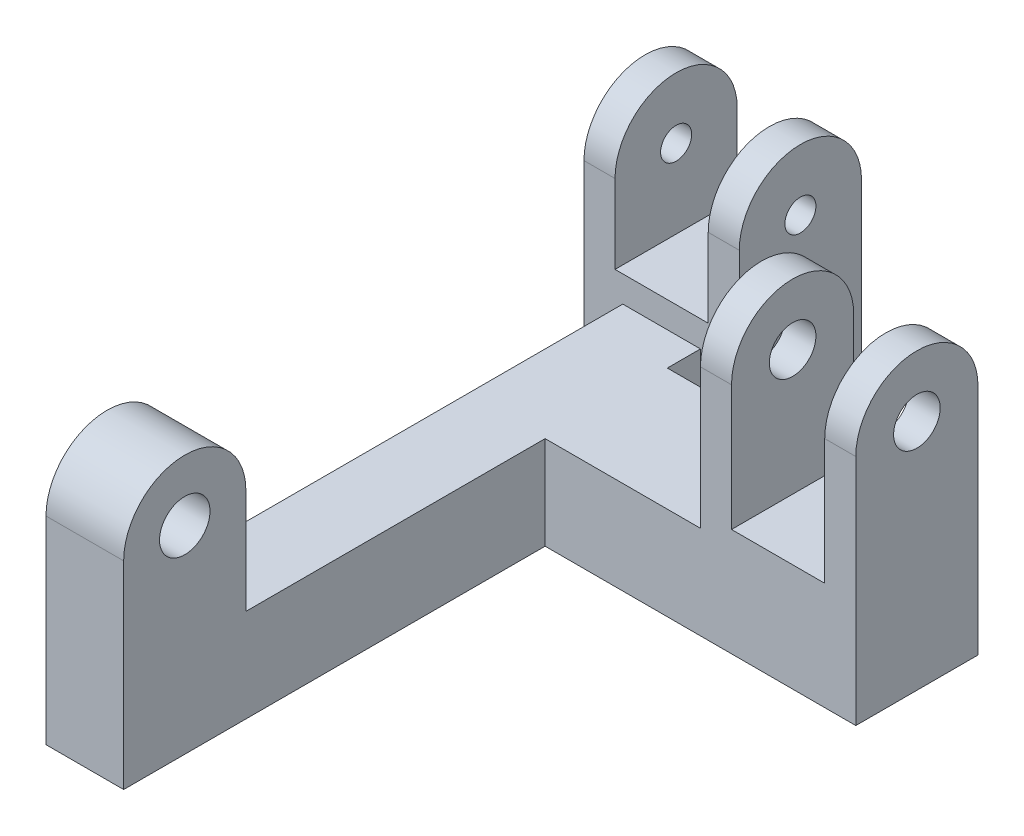
ISO-10303-21;
HEADER;
FILE_DESCRIPTION(('STEP AP214'),'2;1');
FILE_NAME('part.step','',(''),(''),'','','');
FILE_SCHEMA(('AUTOMOTIVE_DESIGN { 1 0 10303 214 1 1 1 1 }'));
ENDSEC;
DATA;
#1=APPLICATION_CONTEXT('core data for automotive mechanical design processes');
#2=APPLICATION_PROTOCOL_DEFINITION('international standard','automotive_design',2000,#1);
#3=PRODUCT_CONTEXT('',#1,'mechanical');
#4=PRODUCT('Part','Part','',(#3));
#5=PRODUCT_RELATED_PRODUCT_CATEGORY('part','',(#4));
#6=PRODUCT_DEFINITION_FORMATION('','',#4);
#7=PRODUCT_DEFINITION_CONTEXT('part definition',#1,'design');
#8=PRODUCT_DEFINITION('design','',#6,#7);
#9=PRODUCT_DEFINITION_SHAPE('','',#8);
#10=(LENGTH_UNIT() NAMED_UNIT(*) SI_UNIT(.MILLI.,.METRE.));
#11=(NAMED_UNIT(*) PLANE_ANGLE_UNIT() SI_UNIT($,.RADIAN.));
#12=(NAMED_UNIT(*) SI_UNIT($,.STERADIAN.) SOLID_ANGLE_UNIT());
#13=UNCERTAINTY_MEASURE_WITH_UNIT(LENGTH_MEASURE(1.E-05),#10,'distance_accuracy_value','');
#14=(GEOMETRIC_REPRESENTATION_CONTEXT(3) GLOBAL_UNCERTAINTY_ASSIGNED_CONTEXT((#13)) GLOBAL_UNIT_ASSIGNED_CONTEXT((#10,
#11,#12)) REPRESENTATION_CONTEXT('',''));
#15=CARTESIAN_POINT('',(0.,0.,0.));
#16=DIRECTION('',(0.,0.,1.));
#17=DIRECTION('',(1.,0.,0.));
#18=AXIS2_PLACEMENT_3D('',#15,#16,#17);
#19=CARTESIAN_POINT('',(-20.,0.,-6.06640543821817));
#20=DIRECTION('',(0.,0.,1.));
#21=DIRECTION('',(1.,0.,0.));
#22=AXIS2_PLACEMENT_3D('',#19,#20,#21);
#23=PLANE('',#22);
#24=DIRECTION('',(1.,0.,0.));
#25=VECTOR('',#24,1.);
#26=CARTESIAN_POINT('',(-20.,-2.25,-6.06640543821817));
#27=LINE('',#26,#25);
#28=CARTESIAN_POINT('',(-14.5,-2.25,-6.06640543821818));
#29=VERTEX_POINT('',#28);
#30=CARTESIAN_POINT('',(-12.5,-2.25,-6.06640543821818));
#31=VERTEX_POINT('',#30);
#32=EDGE_CURVE('E218',#29,#31,#27,.T.);
#33=ORIENTED_EDGE('',*,*,#32,.F.);
#34=DIRECTION('',(0.,-1.,0.));
#35=VECTOR('',#34,1.);
#36=CARTESIAN_POINT('',(-14.5,1.68359456178183,-6.06640543821817));
#37=LINE('',#36,#35);
#38=CARTESIAN_POINT('',(-14.5,-7.31640543821817,-6.06640543821817));
#39=VERTEX_POINT('',#38);
#40=EDGE_CURVE('E200',#29,#39,#37,.T.);
#41=ORIENTED_EDGE('',*,*,#40,.T.);
#42=DIRECTION('',(-1.,0.,0.));
#43=VECTOR('',#42,1.);
#44=CARTESIAN_POINT('',(-14.5,-7.31640543821817,-6.06640543821817));
#45=LINE('',#44,#43);
#46=CARTESIAN_POINT('',(-20.5,-7.31640543821817,-6.06640543821817));
#47=VERTEX_POINT('',#46);
#48=EDGE_CURVE('E433',#39,#47,#45,.T.);
#49=ORIENTED_EDGE('',*,*,#48,.T.);
#50=DIRECTION('',(0.,1.,0.));
#51=VECTOR('',#50,1.);
#52=CARTESIAN_POINT('',(-20.5,1.68359456178183,-6.06640543821817));
#53=LINE('',#52,#51);
#54=CARTESIAN_POINT('',(-20.5,-2.25,-6.06640543821818));
#55=VERTEX_POINT('',#54);
#56=EDGE_CURVE('E435',#47,#55,#53,.T.);
#57=ORIENTED_EDGE('',*,*,#56,.T.);
#58=CARTESIAN_POINT('',(-22.5,-2.25,-6.06640543821818));
#59=VERTEX_POINT('',#58);
#60=EDGE_CURVE('E226',#59,#55,#27,.T.);
#61=ORIENTED_EDGE('',*,*,#60,.F.);
#62=DIRECTION('',(0.,1.,0.));
#63=VECTOR('',#62,1.);
#64=CARTESIAN_POINT('',(-22.5,-2.25,-6.06640543821817));
#65=LINE('',#64,#63);
#66=CARTESIAN_POINT('',(-22.5,-15.,-6.06640543821817));
#67=VERTEX_POINT('',#66);
#68=EDGE_CURVE('E392',#67,#59,#65,.T.);
#69=ORIENTED_EDGE('',*,*,#68,.F.);
#70=DIRECTION('',(1.,0.,0.));
#71=VECTOR('',#70,1.);
#72=CARTESIAN_POINT('',(-22.5,-15.,-6.06640543821817));
#73=LINE('',#72,#71);
#74=CARTESIAN_POINT('',(-20.,-15.,-6.06640543821817));
#75=VERTEX_POINT('',#74);
#76=EDGE_CURVE('E341',#67,#75,#73,.T.);
#77=ORIENTED_EDGE('',*,*,#76,.T.);
#78=DIRECTION('',(0.,-1.,0.));
#79=VECTOR('',#78,1.);
#80=CARTESIAN_POINT('',(-20.,0.,-6.06640543821817));
#81=LINE('',#80,#79);
#82=CARTESIAN_POINT('',(-20.,-9.,-6.06640543821817));
#83=VERTEX_POINT('',#82);
#84=EDGE_CURVE('E47',#83,#75,#81,.T.);
#85=ORIENTED_EDGE('',*,*,#84,.F.);
#86=DIRECTION('',(1.,0.,0.));
#87=VECTOR('',#86,1.);
#88=CARTESIAN_POINT('',(-20.,-9.,-6.06640543821817));
#89=LINE('',#88,#87);
#90=CARTESIAN_POINT('',(-15.,-9.,-6.06640543821817));
#91=VERTEX_POINT('',#90);
#92=EDGE_CURVE('E230',#83,#91,#89,.T.);
#93=ORIENTED_EDGE('',*,*,#92,.T.);
#94=DIRECTION('',(0.,-1.,0.));
#95=VECTOR('',#94,1.);
#96=CARTESIAN_POINT('',(-15.,0.,-6.06640543821817));
#97=LINE('',#96,#95);
#98=CARTESIAN_POINT('',(-15.,-15.,-6.06640543821817));
#99=VERTEX_POINT('',#98);
#100=EDGE_CURVE('E356',#91,#99,#97,.T.);
#101=ORIENTED_EDGE('',*,*,#100,.T.);
#102=CARTESIAN_POINT('',(-12.5,-15.,-6.06640543821817));
#103=VERTEX_POINT('',#102);
#104=EDGE_CURVE('E401',#99,#103,#73,.T.);
#105=ORIENTED_EDGE('',*,*,#104,.T.);
#106=DIRECTION('',(0.,1.,0.));
#107=VECTOR('',#106,1.);
#108=CARTESIAN_POINT('',(-12.5,-2.25,-6.06640543821817));
#109=LINE('',#108,#107);
#110=EDGE_CURVE('E225',#103,#31,#109,.T.);
#111=ORIENTED_EDGE('',*,*,#110,.T.);
#112=EDGE_LOOP('',(#33,#41,#49,#57,#61,#69,#77,#85,#93,#101,#105,#111));
#113=FACE_BOUND('',#112,.T.);
#114=ADVANCED_FACE('F39',(#113),#23,.T.);
#115=CARTESIAN_POINT('',(-20.,-2.25,-10.));
#116=DIRECTION('',(1.,0.,0.));
#117=DIRECTION('',(0.,0.,-1.));
#118=AXIS2_PLACEMENT_3D('',#115,#116,#117);
#119=CYLINDRICAL_SURFACE('',#118,3.93359456178183);
#120=CARTESIAN_POINT('',(-14.5,-2.25,-10.));
#121=DIRECTION('',(1.,0.,0.));
#122=DIRECTION('',(0.,0.,-1.));
#123=AXIS2_PLACEMENT_3D('',#120,#121,#122);
#124=CIRCLE('',#123,3.93359456178183);
#125=CARTESIAN_POINT('',(-14.5,-2.25,-13.9335945617818));
#126=VERTEX_POINT('',#125);
#127=EDGE_CURVE('E204',#29,#126,#124,.F.);
#128=ORIENTED_EDGE('',*,*,#127,.F.);
#129=ORIENTED_EDGE('',*,*,#32,.T.);
#130=CARTESIAN_POINT('',(-12.5,-2.25,-10.));
#131=DIRECTION('',(-1.,0.,0.));
#132=DIRECTION('',(0.,0.,1.));
#133=AXIS2_PLACEMENT_3D('',#130,#131,#132);
#134=CIRCLE('',#133,3.93359456178183);
#135=CARTESIAN_POINT('',(-12.5,-2.25,-13.9335945617818));
#136=VERTEX_POINT('',#135);
#137=EDGE_CURVE('E378',#31,#136,#134,.T.);
#138=ORIENTED_EDGE('',*,*,#137,.T.);
#139=DIRECTION('',(1.,0.,0.));
#140=VECTOR('',#139,1.);
#141=CARTESIAN_POINT('',(-20.,-2.25,-13.9335945617818));
#142=LINE('',#141,#140);
#143=EDGE_CURVE('E220',#126,#136,#142,.T.);
#144=ORIENTED_EDGE('',*,*,#143,.F.);
#145=EDGE_LOOP('',(#128,#129,#138,#144));
#146=FACE_BOUND('',#145,.T.);
#147=ADVANCED_FACE('F216',(#146),#119,.T.);
#148=CARTESIAN_POINT('',(-20.5,-2.25,-10.));
#149=DIRECTION('',(-1.,0.,0.));
#150=DIRECTION('',(0.,0.,1.));
#151=AXIS2_PLACEMENT_3D('',#148,#149,#150);
#152=CIRCLE('',#151,3.93359456178183);
#153=CARTESIAN_POINT('',(-20.5,-2.25,-13.9335945617818));
#154=VERTEX_POINT('',#153);
#155=EDGE_CURVE('E221',#154,#55,#152,.F.);
#156=ORIENTED_EDGE('',*,*,#155,.F.);
#157=CARTESIAN_POINT('',(-22.5,-2.25,-13.9335945617818));
#158=VERTEX_POINT('',#157);
#159=EDGE_CURVE('E227',#158,#154,#142,.T.);
#160=ORIENTED_EDGE('',*,*,#159,.F.);
#161=CARTESIAN_POINT('',(-22.5,-2.25,-10.));
#162=DIRECTION('',(-1.,0.,0.));
#163=DIRECTION('',(0.,0.,1.));
#164=AXIS2_PLACEMENT_3D('',#161,#162,#163);
#165=CIRCLE('',#164,3.93359456178183);
#166=EDGE_CURVE('E395',#59,#158,#165,.T.);
#167=ORIENTED_EDGE('',*,*,#166,.F.);
#168=ORIENTED_EDGE('',*,*,#60,.T.);
#169=EDGE_LOOP('',(#156,#160,#167,#168));
#170=FACE_BOUND('',#169,.T.);
#171=ADVANCED_FACE('F461',(#170),#119,.T.);
#172=CARTESIAN_POINT('',(-20.,0.,-13.9335945617818));
#173=DIRECTION('',(0.,0.,-1.));
#174=DIRECTION('',(0.,1.,0.));
#175=AXIS2_PLACEMENT_3D('',#172,#173,#174);
#176=PLANE('',#175);
#177=DIRECTION('',(1.,0.,0.));
#178=VECTOR('',#177,1.);
#179=CARTESIAN_POINT('',(-20.,-7.31640543821817,-13.9335945617818));
#180=LINE('',#179,#178);
#181=CARTESIAN_POINT('',(-20.5,-7.31640543821817,-13.9335945617818));
#182=VERTEX_POINT('',#181);
#183=CARTESIAN_POINT('',(-14.5,-7.31640543821817,-13.9335945617818));
#184=VERTEX_POINT('',#183);
#185=EDGE_CURVE('E11',#182,#184,#180,.T.);
#186=ORIENTED_EDGE('',*,*,#185,.T.);
#187=DIRECTION('',(0.,1.,0.));
#188=VECTOR('',#187,1.);
#189=CARTESIAN_POINT('',(-14.5,0.,-13.9335945617818));
#190=LINE('',#189,#188);
#191=EDGE_CURVE('E377',#184,#126,#190,.T.);
#192=ORIENTED_EDGE('',*,*,#191,.T.);
#193=ORIENTED_EDGE('',*,*,#143,.T.);
#194=DIRECTION('',(0.,-1.,0.));
#195=VECTOR('',#194,1.);
#196=CARTESIAN_POINT('',(-12.5,-15.,-13.9335945617818));
#197=LINE('',#196,#195);
#198=CARTESIAN_POINT('',(-12.5,-15.,-13.9335945617818));
#199=VERTEX_POINT('',#198);
#200=EDGE_CURVE('E376',#136,#199,#197,.T.);
#201=ORIENTED_EDGE('',*,*,#200,.T.);
#202=DIRECTION('',(1.,0.,0.));
#203=VECTOR('',#202,1.);
#204=CARTESIAN_POINT('',(-20.,-15.,-13.9335945617818));
#205=LINE('',#204,#203);
#206=CARTESIAN_POINT('',(-22.5,-15.,-13.9335945617818));
#207=VERTEX_POINT('',#206);
#208=EDGE_CURVE('E346',#207,#199,#205,.T.);
#209=ORIENTED_EDGE('',*,*,#208,.F.);
#210=DIRECTION('',(0.,-1.,0.));
#211=VECTOR('',#210,1.);
#212=CARTESIAN_POINT('',(-22.5,-15.,-13.9335945617818));
#213=LINE('',#212,#211);
#214=EDGE_CURVE('E398',#158,#207,#213,.T.);
#215=ORIENTED_EDGE('',*,*,#214,.F.);
#216=ORIENTED_EDGE('',*,*,#159,.T.);
#217=DIRECTION('',(0.,-1.,0.));
#218=VECTOR('',#217,1.);
#219=CARTESIAN_POINT('',(-20.5,0.,-13.9335945617818));
#220=LINE('',#219,#218);
#221=EDGE_CURVE('E428',#154,#182,#220,.T.);
#222=ORIENTED_EDGE('',*,*,#221,.T.);
#223=EDGE_LOOP('',(#186,#192,#193,#201,#209,#215,#216,#222));
#224=FACE_BOUND('',#223,.T.);
#225=ADVANCED_FACE('F374',(#224),#176,.T.);
#226=CARTESIAN_POINT('',(-20.,-2.25,-10.));
#227=DIRECTION('',(1.,0.,0.));
#228=DIRECTION('',(0.,0.,-1.));
#229=AXIS2_PLACEMENT_3D('',#226,#227,#228);
#230=CYLINDRICAL_SURFACE('',#229,1.);
#231=CARTESIAN_POINT('',(-12.5,-2.25,-10.));
#232=DIRECTION('',(-1.,0.,0.));
#233=DIRECTION('',(0.,0.,1.));
#234=AXIS2_PLACEMENT_3D('',#231,#232,#233);
#235=CIRCLE('',#234,1.);
#236=CARTESIAN_POINT('',(-12.5,-2.25,-9.));
#237=VERTEX_POINT('',#236);
#238=EDGE_CURVE('E422',#237,#237,#235,.T.);
#239=ORIENTED_EDGE('',*,*,#238,.F.);
#240=EDGE_LOOP('',(#239));
#241=FACE_BOUND('',#240,.T.);
#242=CARTESIAN_POINT('',(-14.5,-2.25,-10.));
#243=DIRECTION('',(1.,0.,0.));
#244=DIRECTION('',(0.,0.,-1.));
#245=AXIS2_PLACEMENT_3D('',#242,#243,#244);
#246=CIRCLE('',#245,1.);
#247=CARTESIAN_POINT('',(-14.5,-2.25,-11.));
#248=VERTEX_POINT('',#247);
#249=EDGE_CURVE('E212',#248,#248,#246,.F.);
#250=ORIENTED_EDGE('',*,*,#249,.T.);
#251=EDGE_LOOP('',(#250));
#252=FACE_BOUND('',#251,.T.);
#253=ADVANCED_FACE('F556',(#241,#252),#230,.F.);
#254=CARTESIAN_POINT('',(-22.5,-2.25,-10.));
#255=DIRECTION('',(-1.,0.,0.));
#256=DIRECTION('',(0.,0.,1.));
#257=AXIS2_PLACEMENT_3D('',#254,#255,#256);
#258=CIRCLE('',#257,1.);
#259=CARTESIAN_POINT('',(-22.5,-2.25,-9.));
#260=VERTEX_POINT('',#259);
#261=EDGE_CURVE('E383',#260,#260,#258,.T.);
#262=ORIENTED_EDGE('',*,*,#261,.T.);
#263=EDGE_LOOP('',(#262));
#264=FACE_BOUND('',#263,.T.);
#265=CARTESIAN_POINT('',(-20.5,-2.25,-10.));
#266=DIRECTION('',(-1.,0.,0.));
#267=DIRECTION('',(0.,0.,1.));
#268=AXIS2_PLACEMENT_3D('',#265,#266,#267);
#269=CIRCLE('',#268,1.);
#270=CARTESIAN_POINT('',(-20.5,-2.25,-9.));
#271=VERTEX_POINT('',#270);
#272=EDGE_CURVE('E437',#271,#271,#269,.F.);
#273=ORIENTED_EDGE('',*,*,#272,.T.);
#274=EDGE_LOOP('',(#273));
#275=FACE_BOUND('',#274,.T.);
#276=ADVANCED_FACE('F445',(#264,#275),#230,.F.);
#277=CARTESIAN_POINT('',(-15.,0.,0.));
#278=DIRECTION('',(-1.,0.,0.));
#279=DIRECTION('',(0.,0.,1.));
#280=AXIS2_PLACEMENT_3D('',#277,#278,#279);
#281=PLANE('',#280);
#282=ORIENTED_EDGE('',*,*,#100,.F.);
#283=DIRECTION('',(0.,0.,-1.));
#284=VECTOR('',#283,1.);
#285=CARTESIAN_POINT('',(-15.,-9.,0.));
#286=LINE('',#285,#284);
#287=CARTESIAN_POINT('',(-15.,-9.,-3.93359456178183));
#288=VERTEX_POINT('',#287);
#289=EDGE_CURVE('E363',#288,#91,#286,.T.);
#290=ORIENTED_EDGE('',*,*,#289,.F.);
#291=DIRECTION('',(0.,-1.,0.));
#292=VECTOR('',#291,1.);
#293=CARTESIAN_POINT('',(-15.,-15.,-3.93359456178183));
#294=LINE('',#293,#292);
#295=CARTESIAN_POINT('',(-15.,-15.,-3.93359456178183));
#296=VERTEX_POINT('',#295);
#297=EDGE_CURVE('E247',#288,#296,#294,.T.);
#298=ORIENTED_EDGE('',*,*,#297,.T.);
#299=DIRECTION('',(0.,0.,-1.));
#300=VECTOR('',#299,1.);
#301=CARTESIAN_POINT('',(-15.,-15.,0.));
#302=LINE('',#301,#300);
#303=EDGE_CURVE('E62',#296,#99,#302,.T.);
#304=ORIENTED_EDGE('',*,*,#303,.T.);
#305=EDGE_LOOP('',(#282,#290,#298,#304));
#306=FACE_BOUND('',#305,.T.);
#307=ADVANCED_FACE('F547',(#306),#281,.F.);
#308=CARTESIAN_POINT('',(-20.,0.,0.));
#309=DIRECTION('',(-1.,0.,0.));
#310=DIRECTION('',(0.,0.,1.));
#311=AXIS2_PLACEMENT_3D('',#308,#309,#310);
#312=PLANE('',#311);
#313=CARTESIAN_POINT('',(-20.,-2.25,27.1328108764363));
#314=DIRECTION('',(-1.,0.,0.));
#315=DIRECTION('',(0.,0.,1.));
#316=AXIS2_PLACEMENT_3D('',#313,#314,#315);
#317=CIRCLE('',#316,1.625);
#318=CARTESIAN_POINT('',(-20.,-2.25,28.7578108764363));
#319=VERTEX_POINT('',#318);
#320=EDGE_CURVE('E369',#319,#319,#317,.T.);
#321=ORIENTED_EDGE('',*,*,#320,.F.);
#322=EDGE_LOOP('',(#321));
#323=FACE_BOUND('',#322,.T.);
#324=DIRECTION('',(0.,0.,-1.));
#325=VECTOR('',#324,1.);
#326=CARTESIAN_POINT('',(-20.,-9.,0.));
#327=LINE('',#326,#325);
#328=CARTESIAN_POINT('',(-20.,-9.,23.1992163146545));
#329=VERTEX_POINT('',#328);
#330=EDGE_CURVE('E335',#329,#83,#327,.T.);
#331=ORIENTED_EDGE('',*,*,#330,.T.);
#332=ORIENTED_EDGE('',*,*,#84,.T.);
#333=DIRECTION('',(0.,0.,-1.));
#334=VECTOR('',#333,1.);
#335=CARTESIAN_POINT('',(-20.,-15.,0.));
#336=LINE('',#335,#334);
#337=CARTESIAN_POINT('',(-20.,-15.,31.0664054382182));
#338=VERTEX_POINT('',#337);
#339=EDGE_CURVE('E333',#338,#75,#336,.T.);
#340=ORIENTED_EDGE('',*,*,#339,.F.);
#341=DIRECTION('',(0.,1.,0.));
#342=VECTOR('',#341,1.);
#343=CARTESIAN_POINT('',(-20.,0.,31.0664054382182));
#344=LINE('',#343,#342);
#345=CARTESIAN_POINT('',(-20.,-2.25,31.0664054382182));
#346=VERTEX_POINT('',#345);
#347=EDGE_CURVE('E406',#338,#346,#344,.T.);
#348=ORIENTED_EDGE('',*,*,#347,.T.);
#349=CARTESIAN_POINT('',(-20.,-2.25,27.1328108764363));
#350=DIRECTION('',(-1.,0.,0.));
#351=DIRECTION('',(0.,0.,1.));
#352=AXIS2_PLACEMENT_3D('',#349,#350,#351);
#353=CIRCLE('',#352,3.93359456178183);
#354=CARTESIAN_POINT('',(-20.,-2.25,23.1992163146545));
#355=VERTEX_POINT('',#354);
#356=EDGE_CURVE('E408',#346,#355,#353,.T.);
#357=ORIENTED_EDGE('',*,*,#356,.T.);
#358=DIRECTION('',(0.,-1.,0.));
#359=VECTOR('',#358,1.);
#360=CARTESIAN_POINT('',(-20.,0.,23.1992163146545));
#361=LINE('',#360,#359);
#362=EDGE_CURVE('E348',#355,#329,#361,.T.);
#363=ORIENTED_EDGE('',*,*,#362,.T.);
#364=EDGE_LOOP('',(#331,#332,#340,#348,#357,#363));
#365=FACE_BOUND('',#364,.T.);
#366=ADVANCED_FACE('F331',(#323,#365),#312,.T.);
#367=CARTESIAN_POINT('',(-5.,0.,0.));
#368=DIRECTION('',(1.,0.,0.));
#369=DIRECTION('',(0.,0.,-1.));
#370=AXIS2_PLACEMENT_3D('',#367,#368,#369);
#371=PLANE('',#370);
#372=CARTESIAN_POINT('',(-5.,0.,0.));
#373=DIRECTION('',(1.,0.,0.));
#374=DIRECTION('',(0.,0.,-1.));
#375=AXIS2_PLACEMENT_3D('',#372,#373,#374);
#376=CIRCLE('',#375,1.5);
#377=CARTESIAN_POINT('',(-5.,0.,-1.5));
#378=VERTEX_POINT('',#377);
#379=EDGE_CURVE('E288',#378,#378,#376,.T.);
#380=ORIENTED_EDGE('',*,*,#379,.T.);
#381=EDGE_LOOP('',(#380));
#382=FACE_BOUND('',#381,.T.);
#383=DIRECTION('',(0.,0.,-1.));
#384=VECTOR('',#383,1.);
#385=CARTESIAN_POINT('',(-5.,-9.,-3.93359456178183));
#386=LINE('',#385,#384);
#387=CARTESIAN_POINT('',(-5.,-9.,3.93359456178183));
#388=VERTEX_POINT('',#387);
#389=CARTESIAN_POINT('',(-5.,-9.,-3.93359456178183));
#390=VERTEX_POINT('',#389);
#391=EDGE_CURVE('E246',#388,#390,#386,.T.);
#392=ORIENTED_EDGE('',*,*,#391,.F.);
#393=DIRECTION('',(0.,-1.,0.));
#394=VECTOR('',#393,1.);
#395=CARTESIAN_POINT('',(-5.,-15.,3.93359456178183));
#396=LINE('',#395,#394);
#397=CARTESIAN_POINT('',(-5.,0.,3.93359456178183));
#398=VERTEX_POINT('',#397);
#399=EDGE_CURVE('E308',#398,#388,#396,.T.);
#400=ORIENTED_EDGE('',*,*,#399,.F.);
#401=CARTESIAN_POINT('',(-5.,0.,0.));
#402=DIRECTION('',(1.,0.,0.));
#403=DIRECTION('',(0.,0.,-1.));
#404=AXIS2_PLACEMENT_3D('',#401,#402,#403);
#405=CIRCLE('',#404,3.93359456178183);
#406=CARTESIAN_POINT('',(-5.,0.,-3.93359456178183));
#407=VERTEX_POINT('',#406);
#408=EDGE_CURVE('E292',#407,#398,#405,.T.);
#409=ORIENTED_EDGE('',*,*,#408,.F.);
#410=DIRECTION('',(0.,1.,0.));
#411=VECTOR('',#410,1.);
#412=CARTESIAN_POINT('',(-5.,0.,-3.93359456178183));
#413=LINE('',#412,#411);
#414=EDGE_CURVE('E299',#390,#407,#413,.T.);
#415=ORIENTED_EDGE('',*,*,#414,.F.);
#416=EDGE_LOOP('',(#392,#400,#409,#415));
#417=FACE_BOUND('',#416,.T.);
#418=ADVANCED_FACE('F505',(#382,#417),#371,.F.);
#419=CARTESIAN_POINT('',(5.,0.,0.));
#420=DIRECTION('',(-1.,0.,0.));
#421=DIRECTION('',(0.,0.,1.));
#422=AXIS2_PLACEMENT_3D('',#419,#420,#421);
#423=CYLINDRICAL_SURFACE('',#422,3.93359456178183);
#424=DIRECTION('',(-1.,0.,0.));
#425=VECTOR('',#424,1.);
#426=CARTESIAN_POINT('',(5.,0.,3.93359456178183));
#427=LINE('',#426,#425);
#428=CARTESIAN_POINT('',(-3.,0.,3.93359456178183));
#429=VERTEX_POINT('',#428);
#430=EDGE_CURVE('E319',#429,#398,#427,.T.);
#431=ORIENTED_EDGE('',*,*,#430,.F.);
#432=CARTESIAN_POINT('',(-3.,0.,0.));
#433=DIRECTION('',(-1.,0.,0.));
#434=DIRECTION('',(0.,0.,1.));
#435=AXIS2_PLACEMENT_3D('',#432,#433,#434);
#436=CIRCLE('',#435,3.93359456178183);
#437=CARTESIAN_POINT('',(-3.,0.,-3.93359456178183));
#438=VERTEX_POINT('',#437);
#439=EDGE_CURVE('E283',#429,#438,#436,.T.);
#440=ORIENTED_EDGE('',*,*,#439,.T.);
#441=DIRECTION('',(-1.,0.,0.));
#442=VECTOR('',#441,1.);
#443=CARTESIAN_POINT('',(5.,0.,-3.93359456178183));
#444=LINE('',#443,#442);
#445=EDGE_CURVE('E305',#438,#407,#444,.T.);
#446=ORIENTED_EDGE('',*,*,#445,.T.);
#447=ORIENTED_EDGE('',*,*,#408,.T.);
#448=EDGE_LOOP('',(#431,#440,#446,#447));
#449=FACE_BOUND('',#448,.T.);
#450=ADVANCED_FACE('F508',(#449),#423,.T.);
#451=CARTESIAN_POINT('',(5.,0.,0.));
#452=DIRECTION('',(-1.,0.,0.));
#453=DIRECTION('',(0.,0.,1.));
#454=AXIS2_PLACEMENT_3D('',#451,#452,#453);
#455=CYLINDRICAL_SURFACE('',#454,1.5);
#456=CARTESIAN_POINT('',(3.,0.,0.));
#457=DIRECTION('',(1.,0.,0.));
#458=DIRECTION('',(0.,0.,-1.));
#459=AXIS2_PLACEMENT_3D('',#456,#457,#458);
#460=CIRCLE('',#459,1.5);
#461=CARTESIAN_POINT('',(3.,0.,-1.5));
#462=VERTEX_POINT('',#461);
#463=EDGE_CURVE('E285',#462,#462,#460,.T.);
#464=ORIENTED_EDGE('',*,*,#463,.F.);
#465=EDGE_LOOP('',(#464));
#466=FACE_BOUND('',#465,.T.);
#467=CARTESIAN_POINT('',(5.,0.,0.));
#468=DIRECTION('',(1.,0.,0.));
#469=DIRECTION('',(0.,0.,-1.));
#470=AXIS2_PLACEMENT_3D('',#467,#468,#469);
#471=CIRCLE('',#470,1.5);
#472=CARTESIAN_POINT('',(5.,0.,-1.5));
#473=VERTEX_POINT('',#472);
#474=EDGE_CURVE('E289',#473,#473,#471,.T.);
#475=ORIENTED_EDGE('',*,*,#474,.T.);
#476=EDGE_LOOP('',(#475));
#477=FACE_BOUND('',#476,.T.);
#478=ADVANCED_FACE('F500',(#466,#477),#455,.F.);
#479=CARTESIAN_POINT('',(5.,0.,0.));
#480=DIRECTION('',(1.,0.,0.));
#481=DIRECTION('',(0.,0.,-1.));
#482=AXIS2_PLACEMENT_3D('',#479,#480,#481);
#483=PLANE('',#482);
#484=CARTESIAN_POINT('',(5.,0.,0.));
#485=DIRECTION('',(1.,0.,0.));
#486=DIRECTION('',(0.,0.,-1.));
#487=AXIS2_PLACEMENT_3D('',#484,#485,#486);
#488=CIRCLE('',#487,3.93359456178183);
#489=CARTESIAN_POINT('',(5.,0.,-3.93359456178183));
#490=VERTEX_POINT('',#489);
#491=CARTESIAN_POINT('',(5.,0.,3.93359456178183));
#492=VERTEX_POINT('',#491);
#493=EDGE_CURVE('E295',#490,#492,#488,.T.);
#494=ORIENTED_EDGE('',*,*,#493,.T.);
#495=DIRECTION('',(0.,-1.,0.));
#496=VECTOR('',#495,1.);
#497=CARTESIAN_POINT('',(5.,-15.,3.93359456178183));
#498=LINE('',#497,#496);
#499=CARTESIAN_POINT('',(5.,-15.,3.93359456178183));
#500=VERTEX_POINT('',#499);
#501=EDGE_CURVE('E298',#492,#500,#498,.T.);
#502=ORIENTED_EDGE('',*,*,#501,.T.);
#503=DIRECTION('',(0.,0.,-1.));
#504=VECTOR('',#503,1.);
#505=CARTESIAN_POINT('',(5.,-15.,3.93359456178183));
#506=LINE('',#505,#504);
#507=CARTESIAN_POINT('',(5.,-15.,-3.93359456178183));
#508=VERTEX_POINT('',#507);
#509=EDGE_CURVE('E301',#500,#508,#506,.T.);
#510=ORIENTED_EDGE('',*,*,#509,.T.);
#511=DIRECTION('',(0.,1.,0.));
#512=VECTOR('',#511,1.);
#513=CARTESIAN_POINT('',(5.,0.,-3.93359456178183));
#514=LINE('',#513,#512);
#515=EDGE_CURVE('E303',#508,#490,#514,.T.);
#516=ORIENTED_EDGE('',*,*,#515,.T.);
#517=EDGE_LOOP('',(#494,#502,#510,#516));
#518=FACE_BOUND('',#517,.T.);
#519=ORIENTED_EDGE('',*,*,#474,.F.);
#520=EDGE_LOOP('',(#519));
#521=FACE_BOUND('',#520,.T.);
#522=ADVANCED_FACE('F501',(#518,#521),#483,.T.);
#523=CARTESIAN_POINT('',(3.,0.,-3.93359456178183));
#524=VERTEX_POINT('',#523);
#525=EDGE_CURVE('E312',#490,#524,#444,.T.);
#526=ORIENTED_EDGE('',*,*,#525,.T.);
#527=CARTESIAN_POINT('',(3.,0.,0.));
#528=DIRECTION('',(1.,0.,0.));
#529=DIRECTION('',(0.,0.,-1.));
#530=AXIS2_PLACEMENT_3D('',#527,#528,#529);
#531=CIRCLE('',#530,3.93359456178183);
#532=CARTESIAN_POINT('',(3.,0.,3.93359456178183));
#533=VERTEX_POINT('',#532);
#534=EDGE_CURVE('E286',#524,#533,#531,.T.);
#535=ORIENTED_EDGE('',*,*,#534,.T.);
#536=EDGE_CURVE('E320',#492,#533,#427,.T.);
#537=ORIENTED_EDGE('',*,*,#536,.F.);
#538=ORIENTED_EDGE('',*,*,#493,.F.);
#539=EDGE_LOOP('',(#526,#535,#537,#538));
#540=FACE_BOUND('',#539,.T.);
#541=ADVANCED_FACE('F41',(#540),#423,.T.);
#542=CARTESIAN_POINT('',(5.,-15.,3.93359456178183));
#543=DIRECTION('',(0.,0.,-1.));
#544=DIRECTION('',(-1.,0.,0.));
#545=AXIS2_PLACEMENT_3D('',#542,#543,#544);
#546=PLANE('',#545);
#547=ORIENTED_EDGE('',*,*,#536,.T.);
#548=DIRECTION('',(0.,1.,0.));
#549=VECTOR('',#548,1.);
#550=CARTESIAN_POINT('',(3.,-8.06640543821817,3.93359456178183));
#551=LINE('',#550,#549);
#552=CARTESIAN_POINT('',(3.,-8.06640543821817,3.93359456178183));
#553=VERTEX_POINT('',#552);
#554=EDGE_CURVE('E260',#553,#533,#551,.T.);
#555=ORIENTED_EDGE('',*,*,#554,.F.);
#556=DIRECTION('',(1.,0.,0.));
#557=VECTOR('',#556,1.);
#558=CARTESIAN_POINT('',(-3.,-8.06640543821817,3.93359456178183));
#559=LINE('',#558,#557);
#560=CARTESIAN_POINT('',(-3.,-8.06640543821817,3.93359456178183));
#561=VERTEX_POINT('',#560);
#562=EDGE_CURVE('E265',#561,#553,#559,.T.);
#563=ORIENTED_EDGE('',*,*,#562,.F.);
#564=DIRECTION('',(0.,-1.,0.));
#565=VECTOR('',#564,1.);
#566=CARTESIAN_POINT('',(-3.,-8.06640543821817,3.93359456178183));
#567=LINE('',#566,#565);
#568=EDGE_CURVE('E263',#429,#561,#567,.T.);
#569=ORIENTED_EDGE('',*,*,#568,.F.);
#570=ORIENTED_EDGE('',*,*,#430,.T.);
#571=ORIENTED_EDGE('',*,*,#399,.T.);
#572=DIRECTION('',(1.,0.,0.));
#573=VECTOR('',#572,1.);
#574=CARTESIAN_POINT('',(-15.,-9.,3.93359456178183));
#575=LINE('',#574,#573);
#576=CARTESIAN_POINT('',(-15.,-9.,3.93359456178183));
#577=VERTEX_POINT('',#576);
#578=EDGE_CURVE('E257',#577,#388,#575,.T.);
#579=ORIENTED_EDGE('',*,*,#578,.F.);
#580=DIRECTION('',(0.,1.,0.));
#581=VECTOR('',#580,1.);
#582=CARTESIAN_POINT('',(-15.,-15.,3.93359456178183));
#583=LINE('',#582,#581);
#584=CARTESIAN_POINT('',(-15.,-15.,3.93359456178183));
#585=VERTEX_POINT('',#584);
#586=EDGE_CURVE('E249',#585,#577,#583,.T.);
#587=ORIENTED_EDGE('',*,*,#586,.F.);
#588=DIRECTION('',(-1.,0.,0.));
#589=VECTOR('',#588,1.);
#590=CARTESIAN_POINT('',(5.,-15.,3.93359456178183));
#591=LINE('',#590,#589);
#592=EDGE_CURVE('E317',#500,#585,#591,.T.);
#593=ORIENTED_EDGE('',*,*,#592,.F.);
#594=ORIENTED_EDGE('',*,*,#501,.F.);
#595=EDGE_LOOP('',(#547,#555,#563,#569,#570,#571,#579,#587,#593,#594));
#596=FACE_BOUND('',#595,.T.);
#597=ADVANCED_FACE('F514',(#596),#546,.F.);
#598=CARTESIAN_POINT('',(5.,-15.,3.93359456178183));
#599=DIRECTION('',(0.,1.,0.));
#600=DIRECTION('',(0.,0.,1.));
#601=AXIS2_PLACEMENT_3D('',#598,#599,#600);
#602=PLANE('',#601);
#603=ORIENTED_EDGE('',*,*,#208,.T.);
#604=DIRECTION('',(0.,0.,1.));
#605=VECTOR('',#604,1.);
#606=CARTESIAN_POINT('',(-12.5,-15.,-6.06640543821817));
#607=LINE('',#606,#605);
#608=EDGE_CURVE('E382',#199,#103,#607,.T.);
#609=ORIENTED_EDGE('',*,*,#608,.T.);
#610=ORIENTED_EDGE('',*,*,#104,.F.);
#611=ORIENTED_EDGE('',*,*,#303,.F.);
#612=DIRECTION('',(-1.,0.,0.));
#613=VECTOR('',#612,1.);
#614=CARTESIAN_POINT('',(5.,-15.,-3.93359456178183));
#615=LINE('',#614,#613);
#616=EDGE_CURVE('E315',#508,#296,#615,.T.);
#617=ORIENTED_EDGE('',*,*,#616,.F.);
#618=ORIENTED_EDGE('',*,*,#509,.F.);
#619=ORIENTED_EDGE('',*,*,#592,.T.);
#620=CARTESIAN_POINT('',(-15.,-15.,31.0664054382182));
#621=VERTEX_POINT('',#620);
#622=EDGE_CURVE('E367',#621,#585,#302,.T.);
#623=ORIENTED_EDGE('',*,*,#622,.F.);
#624=DIRECTION('',(1.,0.,0.));
#625=VECTOR('',#624,1.);
#626=CARTESIAN_POINT('',(-20.,-15.,31.0664054382182));
#627=LINE('',#626,#625);
#628=EDGE_CURVE('E343',#338,#621,#627,.T.);
#629=ORIENTED_EDGE('',*,*,#628,.F.);
#630=ORIENTED_EDGE('',*,*,#339,.T.);
#631=ORIENTED_EDGE('',*,*,#76,.F.);
#632=DIRECTION('',(0.,0.,1.));
#633=VECTOR('',#632,1.);
#634=CARTESIAN_POINT('',(-22.5,-15.,-6.06640543821817));
#635=LINE('',#634,#633);
#636=EDGE_CURVE('E386',#207,#67,#635,.T.);
#637=ORIENTED_EDGE('',*,*,#636,.F.);
#638=EDGE_LOOP('',(#603,#609,#610,#611,#617,#618,#619,#623,#629,#630,#631,#637));
#639=FACE_BOUND('',#638,.T.);
#640=ADVANCED_FACE('F339',(#639),#602,.F.);
#641=CARTESIAN_POINT('',(5.,0.,-3.93359456178183));
#642=DIRECTION('',(0.,0.,1.));
#643=DIRECTION('',(1.,0.,0.));
#644=AXIS2_PLACEMENT_3D('',#641,#642,#643);
#645=PLANE('',#644);
#646=DIRECTION('',(1.,0.,0.));
#647=VECTOR('',#646,1.);
#648=CARTESIAN_POINT('',(-3.,-8.06640543821817,-3.93359456178183));
#649=LINE('',#648,#647);
#650=CARTESIAN_POINT('',(-3.,-8.06640543821817,-3.93359456178183));
#651=VERTEX_POINT('',#650);
#652=CARTESIAN_POINT('',(3.,-8.06640543821817,-3.93359456178183));
#653=VERTEX_POINT('',#652);
#654=EDGE_CURVE('E274',#651,#653,#649,.T.);
#655=ORIENTED_EDGE('',*,*,#654,.T.);
#656=DIRECTION('',(0.,1.,0.));
#657=VECTOR('',#656,1.);
#658=CARTESIAN_POINT('',(3.,-8.06640543821817,-3.93359456178183));
#659=LINE('',#658,#657);
#660=EDGE_CURVE('E268',#653,#524,#659,.T.);
#661=ORIENTED_EDGE('',*,*,#660,.T.);
#662=ORIENTED_EDGE('',*,*,#525,.F.);
#663=ORIENTED_EDGE('',*,*,#515,.F.);
#664=ORIENTED_EDGE('',*,*,#616,.T.);
#665=ORIENTED_EDGE('',*,*,#297,.F.);
#666=DIRECTION('',(1.,0.,0.));
#667=VECTOR('',#666,1.);
#668=CARTESIAN_POINT('',(-15.,-9.,-3.93359456178183));
#669=LINE('',#668,#667);
#670=EDGE_CURVE('E252',#288,#390,#669,.T.);
#671=ORIENTED_EDGE('',*,*,#670,.T.);
#672=ORIENTED_EDGE('',*,*,#414,.T.);
#673=ORIENTED_EDGE('',*,*,#445,.F.);
#674=DIRECTION('',(0.,-1.,0.));
#675=VECTOR('',#674,1.);
#676=CARTESIAN_POINT('',(-3.,-8.06640543821817,-3.93359456178183));
#677=LINE('',#676,#675);
#678=EDGE_CURVE('E271',#438,#651,#677,.T.);
#679=ORIENTED_EDGE('',*,*,#678,.T.);
#680=EDGE_LOOP('',(#655,#661,#662,#663,#664,#665,#671,#672,#673,#679));
#681=FACE_BOUND('',#680,.T.);
#682=ADVANCED_FACE('F498',(#681),#645,.F.);
#683=CARTESIAN_POINT('',(-3.,0.,0.));
#684=DIRECTION('',(-1.,0.,0.));
#685=DIRECTION('',(0.,0.,1.));
#686=AXIS2_PLACEMENT_3D('',#683,#684,#685);
#687=CIRCLE('',#686,1.5);
#688=CARTESIAN_POINT('',(-3.,0.,1.5));
#689=VERTEX_POINT('',#688);
#690=EDGE_CURVE('E280',#689,#689,#687,.T.);
#691=ORIENTED_EDGE('',*,*,#690,.F.);
#692=EDGE_LOOP('',(#691));
#693=FACE_BOUND('',#692,.T.);
#694=ORIENTED_EDGE('',*,*,#379,.F.);
#695=EDGE_LOOP('',(#694));
#696=FACE_BOUND('',#695,.T.);
#697=ADVANCED_FACE('F494',(#693,#696),#455,.F.);
#698=CARTESIAN_POINT('',(3.,-8.06640543821817,-3.93359456178183));
#699=DIRECTION('',(1.,0.,0.));
#700=DIRECTION('',(0.,0.,-1.));
#701=AXIS2_PLACEMENT_3D('',#698,#699,#700);
#702=PLANE('',#701);
#703=ORIENTED_EDGE('',*,*,#463,.T.);
#704=EDGE_LOOP('',(#703));
#705=FACE_BOUND('',#704,.T.);
#706=ORIENTED_EDGE('',*,*,#660,.F.);
#707=DIRECTION('',(0.,0.,1.));
#708=VECTOR('',#707,1.);
#709=CARTESIAN_POINT('',(3.,-8.06640543821817,-3.93359456178183));
#710=LINE('',#709,#708);
#711=EDGE_CURVE('E278',#653,#553,#710,.T.);
#712=ORIENTED_EDGE('',*,*,#711,.T.);
#713=ORIENTED_EDGE('',*,*,#554,.T.);
#714=ORIENTED_EDGE('',*,*,#534,.F.);
#715=EDGE_LOOP('',(#706,#712,#713,#714));
#716=FACE_BOUND('',#715,.T.);
#717=ADVANCED_FACE('F490',(#705,#716),#702,.F.);
#718=CARTESIAN_POINT('',(-3.,-8.06640543821817,-3.93359456178183));
#719=DIRECTION('',(-1.,0.,0.));
#720=DIRECTION('',(0.,0.,1.));
#721=AXIS2_PLACEMENT_3D('',#718,#719,#720);
#722=PLANE('',#721);
#723=ORIENTED_EDGE('',*,*,#690,.T.);
#724=EDGE_LOOP('',(#723));
#725=FACE_BOUND('',#724,.T.);
#726=ORIENTED_EDGE('',*,*,#568,.T.);
#727=DIRECTION('',(0.,0.,1.));
#728=VECTOR('',#727,1.);
#729=CARTESIAN_POINT('',(-3.,-8.06640543821817,-3.93359456178183));
#730=LINE('',#729,#728);
#731=EDGE_CURVE('E277',#651,#561,#730,.T.);
#732=ORIENTED_EDGE('',*,*,#731,.F.);
#733=ORIENTED_EDGE('',*,*,#678,.F.);
#734=ORIENTED_EDGE('',*,*,#439,.F.);
#735=EDGE_LOOP('',(#726,#732,#733,#734));
#736=FACE_BOUND('',#735,.T.);
#737=ADVANCED_FACE('F486',(#725,#736),#722,.F.);
#738=CARTESIAN_POINT('',(-3.,-8.06640543821817,-3.93359456178183));
#739=DIRECTION('',(0.,-1.,0.));
#740=DIRECTION('',(0.,0.,-1.));
#741=AXIS2_PLACEMENT_3D('',#738,#739,#740);
#742=PLANE('',#741);
#743=ORIENTED_EDGE('',*,*,#711,.F.);
#744=ORIENTED_EDGE('',*,*,#654,.F.);
#745=ORIENTED_EDGE('',*,*,#731,.T.);
#746=ORIENTED_EDGE('',*,*,#562,.T.);
#747=EDGE_LOOP('',(#743,#744,#745,#746));
#748=FACE_BOUND('',#747,.T.);
#749=ADVANCED_FACE('F483',(#748),#742,.F.);
#750=CARTESIAN_POINT('',(-15.,-9.,-3.93359456178183));
#751=DIRECTION('',(0.,-1.,0.));
#752=DIRECTION('',(0.,0.,-1.));
#753=AXIS2_PLACEMENT_3D('',#750,#751,#752);
#754=PLANE('',#753);
#755=ORIENTED_EDGE('',*,*,#391,.T.);
#756=ORIENTED_EDGE('',*,*,#670,.F.);
#757=ORIENTED_EDGE('',*,*,#289,.T.);
#758=ORIENTED_EDGE('',*,*,#92,.F.);
#759=ORIENTED_EDGE('',*,*,#330,.F.);
#760=DIRECTION('',(1.,0.,0.));
#761=VECTOR('',#760,1.);
#762=CARTESIAN_POINT('',(-20.,-9.,23.1992163146545));
#763=LINE('',#762,#761);
#764=CARTESIAN_POINT('',(-15.,-9.,23.1992163146545));
#765=VERTEX_POINT('',#764);
#766=EDGE_CURVE('E237',#329,#765,#763,.T.);
#767=ORIENTED_EDGE('',*,*,#766,.T.);
#768=EDGE_CURVE('E364',#765,#577,#286,.T.);
#769=ORIENTED_EDGE('',*,*,#768,.T.);
#770=ORIENTED_EDGE('',*,*,#578,.T.);
#771=EDGE_LOOP('',(#755,#756,#757,#758,#759,#767,#769,#770));
#772=FACE_BOUND('',#771,.T.);
#773=ADVANCED_FACE('F417',(#772),#754,.F.);
#774=CARTESIAN_POINT('',(-15.,-2.25,27.1328108764363));
#775=DIRECTION('',(-1.,0.,0.));
#776=DIRECTION('',(0.,0.,1.));
#777=AXIS2_PLACEMENT_3D('',#774,#775,#776);
#778=CIRCLE('',#777,1.625);
#779=CARTESIAN_POINT('',(-15.,-2.25,28.7578108764363));
#780=VERTEX_POINT('',#779);
#781=EDGE_CURVE('E352',#780,#780,#778,.T.);
#782=ORIENTED_EDGE('',*,*,#781,.T.);
#783=EDGE_LOOP('',(#782));
#784=FACE_BOUND('',#783,.T.);
#785=ORIENTED_EDGE('',*,*,#622,.T.);
#786=ORIENTED_EDGE('',*,*,#586,.T.);
#787=ORIENTED_EDGE('',*,*,#768,.F.);
#788=DIRECTION('',(0.,-1.,0.));
#789=VECTOR('',#788,1.);
#790=CARTESIAN_POINT('',(-15.,0.,23.1992163146545));
#791=LINE('',#790,#789);
#792=CARTESIAN_POINT('',(-15.,-2.25,23.1992163146545));
#793=VERTEX_POINT('',#792);
#794=EDGE_CURVE('E361',#793,#765,#791,.T.);
#795=ORIENTED_EDGE('',*,*,#794,.F.);
#796=CARTESIAN_POINT('',(-15.,-2.25,27.1328108764363));
#797=DIRECTION('',(-1.,0.,0.));
#798=DIRECTION('',(0.,0.,1.));
#799=AXIS2_PLACEMENT_3D('',#796,#797,#798);
#800=CIRCLE('',#799,3.93359456178183);
#801=CARTESIAN_POINT('',(-15.,-2.25,31.0664054382182));
#802=VERTEX_POINT('',#801);
#803=EDGE_CURVE('E359',#802,#793,#800,.T.);
#804=ORIENTED_EDGE('',*,*,#803,.F.);
#805=DIRECTION('',(0.,1.,0.));
#806=VECTOR('',#805,1.);
#807=CARTESIAN_POINT('',(-15.,0.,31.0664054382182));
#808=LINE('',#807,#806);
#809=EDGE_CURVE('E355',#621,#802,#808,.T.);
#810=ORIENTED_EDGE('',*,*,#809,.F.);
#811=EDGE_LOOP('',(#785,#786,#787,#795,#804,#810));
#812=FACE_BOUND('',#811,.T.);
#813=ADVANCED_FACE('F475',(#784,#812),#281,.F.);
#814=CARTESIAN_POINT('',(-20.,0.,31.0664054382182));
#815=DIRECTION('',(0.,0.,-1.));
#816=DIRECTION('',(-1.,0.,0.));
#817=AXIS2_PLACEMENT_3D('',#814,#815,#816);
#818=PLANE('',#817);
#819=ORIENTED_EDGE('',*,*,#809,.T.);
#820=DIRECTION('',(1.,0.,0.));
#821=VECTOR('',#820,1.);
#822=CARTESIAN_POINT('',(-20.,-2.25,31.0664054382182));
#823=LINE('',#822,#821);
#824=EDGE_CURVE('E243',#346,#802,#823,.T.);
#825=ORIENTED_EDGE('',*,*,#824,.F.);
#826=ORIENTED_EDGE('',*,*,#347,.F.);
#827=ORIENTED_EDGE('',*,*,#628,.T.);
#828=EDGE_LOOP('',(#819,#825,#826,#827));
#829=FACE_BOUND('',#828,.T.);
#830=ADVANCED_FACE('F471',(#829),#818,.F.);
#831=CARTESIAN_POINT('',(-20.,-2.25,27.1328108764363));
#832=DIRECTION('',(1.,0.,0.));
#833=DIRECTION('',(0.,0.,-1.));
#834=AXIS2_PLACEMENT_3D('',#831,#832,#833);
#835=CYLINDRICAL_SURFACE('',#834,3.93359456178183);
#836=ORIENTED_EDGE('',*,*,#803,.T.);
#837=DIRECTION('',(1.,0.,0.));
#838=VECTOR('',#837,1.);
#839=CARTESIAN_POINT('',(-20.,-2.25,23.1992163146545));
#840=LINE('',#839,#838);
#841=EDGE_CURVE('E240',#355,#793,#840,.T.);
#842=ORIENTED_EDGE('',*,*,#841,.F.);
#843=ORIENTED_EDGE('',*,*,#356,.F.);
#844=ORIENTED_EDGE('',*,*,#824,.T.);
#845=EDGE_LOOP('',(#836,#842,#843,#844));
#846=FACE_BOUND('',#845,.T.);
#847=ADVANCED_FACE('F468',(#846),#835,.T.);
#848=CARTESIAN_POINT('',(-20.,0.,23.1992163146545));
#849=DIRECTION('',(0.,0.,1.));
#850=DIRECTION('',(1.,0.,0.));
#851=AXIS2_PLACEMENT_3D('',#848,#849,#850);
#852=PLANE('',#851);
#853=ORIENTED_EDGE('',*,*,#794,.T.);
#854=ORIENTED_EDGE('',*,*,#766,.F.);
#855=ORIENTED_EDGE('',*,*,#362,.F.);
#856=ORIENTED_EDGE('',*,*,#841,.T.);
#857=EDGE_LOOP('',(#853,#854,#855,#856));
#858=FACE_BOUND('',#857,.T.);
#859=ADVANCED_FACE('F413',(#858),#852,.F.);
#860=CARTESIAN_POINT('',(-20.,-2.25,27.1328108764363));
#861=DIRECTION('',(1.,0.,0.));
#862=DIRECTION('',(0.,0.,-1.));
#863=AXIS2_PLACEMENT_3D('',#860,#861,#862);
#864=CYLINDRICAL_SURFACE('',#863,1.625);
#865=ORIENTED_EDGE('',*,*,#320,.T.);
#866=EDGE_LOOP('',(#865));
#867=FACE_BOUND('',#866,.T.);
#868=ORIENTED_EDGE('',*,*,#781,.F.);
#869=EDGE_LOOP('',(#868));
#870=FACE_BOUND('',#869,.T.);
#871=ADVANCED_FACE('F467',(#867,#870),#864,.F.);
#872=CARTESIAN_POINT('',(-22.5,-2.25,-10.));
#873=DIRECTION('',(-1.,0.,0.));
#874=DIRECTION('',(0.,0.,1.));
#875=AXIS2_PLACEMENT_3D('',#872,#873,#874);
#876=PLANE('',#875);
#877=ORIENTED_EDGE('',*,*,#636,.T.);
#878=ORIENTED_EDGE('',*,*,#68,.T.);
#879=ORIENTED_EDGE('',*,*,#166,.T.);
#880=ORIENTED_EDGE('',*,*,#214,.T.);
#881=EDGE_LOOP('',(#877,#878,#879,#880));
#882=FACE_BOUND('',#881,.T.);
#883=ORIENTED_EDGE('',*,*,#261,.F.);
#884=EDGE_LOOP('',(#883));
#885=FACE_BOUND('',#884,.T.);
#886=ADVANCED_FACE('F479',(#882,#885),#876,.T.);
#887=CARTESIAN_POINT('',(-12.5,-2.25,-10.));
#888=DIRECTION('',(-1.,0.,0.));
#889=DIRECTION('',(0.,0.,1.));
#890=AXIS2_PLACEMENT_3D('',#887,#888,#889);
#891=PLANE('',#890);
#892=ORIENTED_EDGE('',*,*,#238,.T.);
#893=EDGE_LOOP('',(#892));
#894=FACE_BOUND('',#893,.T.);
#895=ORIENTED_EDGE('',*,*,#608,.F.);
#896=ORIENTED_EDGE('',*,*,#200,.F.);
#897=ORIENTED_EDGE('',*,*,#137,.F.);
#898=ORIENTED_EDGE('',*,*,#110,.F.);
#899=EDGE_LOOP('',(#895,#896,#897,#898));
#900=FACE_BOUND('',#899,.T.);
#901=ADVANCED_FACE('F381',(#894,#900),#891,.F.);
#902=CARTESIAN_POINT('',(-14.5,1.68359456178183,-13.9336065617818));
#903=DIRECTION('',(-1.,0.,0.));
#904=DIRECTION('',(0.,0.,1.));
#905=AXIS2_PLACEMENT_3D('',#902,#903,#904);
#906=PLANE('',#905);
#907=DIRECTION('',(0.,0.,1.));
#908=VECTOR('',#907,1.);
#909=CARTESIAN_POINT('',(-14.5,-7.31640543821817,-13.9336065617818));
#910=LINE('',#909,#908);
#911=EDGE_CURVE('E207',#184,#39,#910,.T.);
#912=ORIENTED_EDGE('',*,*,#911,.T.);
#913=ORIENTED_EDGE('',*,*,#40,.F.);
#914=ORIENTED_EDGE('',*,*,#127,.T.);
#915=ORIENTED_EDGE('',*,*,#191,.F.);
#916=EDGE_LOOP('',(#912,#913,#914,#915));
#917=FACE_BOUND('',#916,.T.);
#918=ORIENTED_EDGE('',*,*,#249,.F.);
#919=EDGE_LOOP('',(#918));
#920=FACE_BOUND('',#919,.T.);
#921=ADVANCED_FACE('F202',(#917,#920),#906,.T.);
#922=CARTESIAN_POINT('',(-14.5,-7.31640543821817,-13.9336065617818));
#923=DIRECTION('',(0.,1.,0.));
#924=DIRECTION('',(0.,0.,1.));
#925=AXIS2_PLACEMENT_3D('',#922,#923,#924);
#926=PLANE('',#925);
#927=DIRECTION('',(0.,0.,1.));
#928=VECTOR('',#927,1.);
#929=CARTESIAN_POINT('',(-20.5,-7.31640543821817,-13.9336065617818));
#930=LINE('',#929,#928);
#931=EDGE_CURVE('E54',#182,#47,#930,.T.);
#932=ORIENTED_EDGE('',*,*,#931,.T.);
#933=ORIENTED_EDGE('',*,*,#48,.F.);
#934=ORIENTED_EDGE('',*,*,#911,.F.);
#935=ORIENTED_EDGE('',*,*,#185,.F.);
#936=EDGE_LOOP('',(#932,#933,#934,#935));
#937=FACE_BOUND('',#936,.T.);
#938=ADVANCED_FACE('F449',(#937),#926,.T.);
#939=CARTESIAN_POINT('',(-20.5,1.68359456178183,-13.9336065617818));
#940=DIRECTION('',(1.,0.,0.));
#941=DIRECTION('',(0.,0.,-1.));
#942=AXIS2_PLACEMENT_3D('',#939,#940,#941);
#943=PLANE('',#942);
#944=ORIENTED_EDGE('',*,*,#155,.T.);
#945=ORIENTED_EDGE('',*,*,#56,.F.);
#946=ORIENTED_EDGE('',*,*,#931,.F.);
#947=ORIENTED_EDGE('',*,*,#221,.F.);
#948=EDGE_LOOP('',(#944,#945,#946,#947));
#949=FACE_BOUND('',#948,.T.);
#950=ORIENTED_EDGE('',*,*,#272,.F.);
#951=EDGE_LOOP('',(#950));
#952=FACE_BOUND('',#951,.T.);
#953=ADVANCED_FACE('F447',(#949,#952),#943,.T.);
#954=CLOSED_SHELL('',(#114,#147,#171,#225,#253,#276,#307,#366,#418,#450,#478,#522,#541,#597,
#640,#682,#697,#717,#737,#749,#773,#813,#830,#847,#859,#871,#886,#901,#921,#938,#953));
#955=MANIFOLD_SOLID_BREP('B2',#954);
#956=ADVANCED_BREP_SHAPE_REPRESENTATION('',(#18,#955),#14);
#957=SHAPE_DEFINITION_REPRESENTATION(#9,#956);
ENDSEC;
END-ISO-10303-21;
